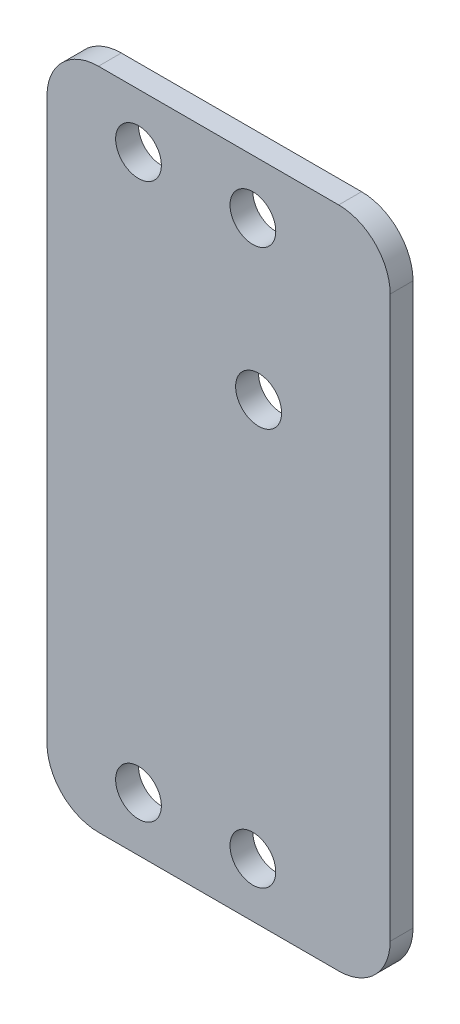
ISO-10303-21;
HEADER;
FILE_DESCRIPTION(('STEP AP214'),'2;1');
FILE_NAME('part.step','',(''),(''),'','','');
FILE_SCHEMA(('AUTOMOTIVE_DESIGN { 1 0 10303 214 1 1 1 1 }'));
ENDSEC;
DATA;
#1=APPLICATION_CONTEXT('core data for automotive mechanical design processes');
#2=APPLICATION_PROTOCOL_DEFINITION('international standard','automotive_design',2000,#1);
#3=PRODUCT_CONTEXT('',#1,'mechanical');
#4=PRODUCT('Part','Part','',(#3));
#5=PRODUCT_RELATED_PRODUCT_CATEGORY('part','',(#4));
#6=PRODUCT_DEFINITION_FORMATION('','',#4);
#7=PRODUCT_DEFINITION_CONTEXT('part definition',#1,'design');
#8=PRODUCT_DEFINITION('design','',#6,#7);
#9=PRODUCT_DEFINITION_SHAPE('','',#8);
#10=(LENGTH_UNIT() NAMED_UNIT(*) SI_UNIT(.MILLI.,.METRE.));
#11=(NAMED_UNIT(*) PLANE_ANGLE_UNIT() SI_UNIT($,.RADIAN.));
#12=(NAMED_UNIT(*) SI_UNIT($,.STERADIAN.) SOLID_ANGLE_UNIT());
#13=UNCERTAINTY_MEASURE_WITH_UNIT(LENGTH_MEASURE(1.E-05),#10,'distance_accuracy_value','');
#14=(GEOMETRIC_REPRESENTATION_CONTEXT(3) GLOBAL_UNCERTAINTY_ASSIGNED_CONTEXT((#13)) GLOBAL_UNIT_ASSIGNED_CONTEXT((#10,
#11,#12)) REPRESENTATION_CONTEXT('',''));
#15=CARTESIAN_POINT('',(0.,0.,0.));
#16=DIRECTION('',(0.,0.,1.));
#17=DIRECTION('',(1.,0.,0.));
#18=AXIS2_PLACEMENT_3D('',#15,#16,#17);
#19=CARTESIAN_POINT('',(0.,0.,2.));
#20=DIRECTION('',(0.,0.,1.));
#21=DIRECTION('',(1.,0.,0.));
#22=AXIS2_PLACEMENT_3D('',#19,#20,#21);
#23=PLANE('',#22);
#24=CARTESIAN_POINT('',(3.,-24.25,2.));
#25=DIRECTION('',(0.,0.,1.));
#26=DIRECTION('',(1.,0.,0.));
#27=AXIS2_PLACEMENT_3D('',#24,#25,#26);
#28=CIRCLE('',#27,2.);
#29=CARTESIAN_POINT('',(5.,-24.25,2.));
#30=VERTEX_POINT('',#29);
#31=EDGE_CURVE('E197',#30,#30,#28,.T.);
#32=ORIENTED_EDGE('',*,*,#31,.F.);
#33=EDGE_LOOP('',(#32));
#34=FACE_BOUND('',#33,.T.);
#35=CARTESIAN_POINT('',(-7.00000000000001,24.25,2.));
#36=DIRECTION('',(0.,0.,1.));
#37=DIRECTION('',(1.,0.,0.));
#38=AXIS2_PLACEMENT_3D('',#35,#36,#37);
#39=CIRCLE('',#38,2.);
#40=CARTESIAN_POINT('',(-5.00000000000001,24.25,2.));
#41=VERTEX_POINT('',#40);
#42=EDGE_CURVE('E186',#41,#41,#39,.T.);
#43=ORIENTED_EDGE('',*,*,#42,.F.);
#44=EDGE_LOOP('',(#43));
#45=FACE_BOUND('',#44,.T.);
#46=DIRECTION('',(1.,0.,0.));
#47=VECTOR('',#46,1.);
#48=CARTESIAN_POINT('',(-15.,-29.,2.));
#49=LINE('',#48,#47);
#50=CARTESIAN_POINT('',(-10.5,-29.,2.));
#51=VERTEX_POINT('',#50);
#52=CARTESIAN_POINT('',(10.5,-29.,2.));
#53=VERTEX_POINT('',#52);
#54=EDGE_CURVE('E173',#51,#53,#49,.T.);
#55=ORIENTED_EDGE('',*,*,#54,.T.);
#56=CARTESIAN_POINT('',(10.5,-24.5,2.));
#57=DIRECTION('',(0.,0.,1.));
#58=DIRECTION('',(1.,0.,0.));
#59=AXIS2_PLACEMENT_3D('',#56,#57,#58);
#60=CIRCLE('',#59,4.5);
#61=CARTESIAN_POINT('',(15.,-24.5,2.));
#62=VERTEX_POINT('',#61);
#63=EDGE_CURVE('E153',#53,#62,#60,.T.);
#64=ORIENTED_EDGE('',*,*,#63,.T.);
#65=DIRECTION('',(0.,1.,0.));
#66=VECTOR('',#65,1.);
#67=CARTESIAN_POINT('',(15.,29.,2.));
#68=LINE('',#67,#66);
#69=CARTESIAN_POINT('',(15.,24.5,2.));
#70=VERTEX_POINT('',#69);
#71=EDGE_CURVE('E104',#62,#70,#68,.T.);
#72=ORIENTED_EDGE('',*,*,#71,.T.);
#73=CARTESIAN_POINT('',(10.5,24.5,2.));
#74=DIRECTION('',(0.,0.,1.));
#75=DIRECTION('',(1.,0.,0.));
#76=AXIS2_PLACEMENT_3D('',#73,#74,#75);
#77=CIRCLE('',#76,4.5);
#78=CARTESIAN_POINT('',(10.5,29.,2.));
#79=VERTEX_POINT('',#78);
#80=EDGE_CURVE('E147',#70,#79,#77,.T.);
#81=ORIENTED_EDGE('',*,*,#80,.T.);
#82=DIRECTION('',(-1.,0.,0.));
#83=VECTOR('',#82,1.);
#84=CARTESIAN_POINT('',(-15.,29.,2.));
#85=LINE('',#84,#83);
#86=CARTESIAN_POINT('',(-10.5,29.,2.));
#87=VERTEX_POINT('',#86);
#88=EDGE_CURVE('E135',#79,#87,#85,.T.);
#89=ORIENTED_EDGE('',*,*,#88,.T.);
#90=CARTESIAN_POINT('',(-10.5,24.5,2.));
#91=DIRECTION('',(0.,0.,1.));
#92=DIRECTION('',(1.,0.,0.));
#93=AXIS2_PLACEMENT_3D('',#90,#91,#92);
#94=CIRCLE('',#93,4.5);
#95=CARTESIAN_POINT('',(-15.,24.5,2.));
#96=VERTEX_POINT('',#95);
#97=EDGE_CURVE('E144',#87,#96,#94,.T.);
#98=ORIENTED_EDGE('',*,*,#97,.T.);
#99=DIRECTION('',(0.,-1.,0.));
#100=VECTOR('',#99,1.);
#101=CARTESIAN_POINT('',(-15.,29.,2.));
#102=LINE('',#101,#100);
#103=CARTESIAN_POINT('',(-15.,-24.5,2.));
#104=VERTEX_POINT('',#103);
#105=EDGE_CURVE('E129',#96,#104,#102,.T.);
#106=ORIENTED_EDGE('',*,*,#105,.T.);
#107=CARTESIAN_POINT('',(-10.5,-24.5,2.));
#108=DIRECTION('',(0.,0.,1.));
#109=DIRECTION('',(1.,0.,0.));
#110=AXIS2_PLACEMENT_3D('',#107,#108,#109);
#111=CIRCLE('',#110,4.5);
#112=EDGE_CURVE('E150',#104,#51,#111,.T.);
#113=ORIENTED_EDGE('',*,*,#112,.T.);
#114=EDGE_LOOP('',(#55,#64,#72,#81,#89,#98,#106,#113));
#115=FACE_BOUND('',#114,.T.);
#116=CARTESIAN_POINT('',(2.99999999999999,24.25,2.));
#117=DIRECTION('',(0.,0.,1.));
#118=DIRECTION('',(1.,0.,0.));
#119=AXIS2_PLACEMENT_3D('',#116,#117,#118);
#120=CIRCLE('',#119,2.);
#121=CARTESIAN_POINT('',(4.99999999999999,24.25,2.));
#122=VERTEX_POINT('',#121);
#123=EDGE_CURVE('E181',#122,#122,#120,.T.);
#124=ORIENTED_EDGE('',*,*,#123,.F.);
#125=EDGE_LOOP('',(#124));
#126=FACE_BOUND('',#125,.T.);
#127=CARTESIAN_POINT('',(-7.,-24.25,2.));
#128=DIRECTION('',(0.,0.,1.));
#129=DIRECTION('',(1.,0.,0.));
#130=AXIS2_PLACEMENT_3D('',#127,#128,#129);
#131=CIRCLE('',#130,2.);
#132=CARTESIAN_POINT('',(-5.,-24.25,2.));
#133=VERTEX_POINT('',#132);
#134=EDGE_CURVE('E191',#133,#133,#131,.T.);
#135=ORIENTED_EDGE('',*,*,#134,.F.);
#136=EDGE_LOOP('',(#135));
#137=FACE_BOUND('',#136,.T.);
#138=CARTESIAN_POINT('',(3.5,10.75,2.));
#139=DIRECTION('',(0.,0.,1.));
#140=DIRECTION('',(1.,0.,0.));
#141=AXIS2_PLACEMENT_3D('',#138,#139,#140);
#142=CIRCLE('',#141,2.01);
#143=CARTESIAN_POINT('',(5.51,10.75,2.));
#144=VERTEX_POINT('',#143);
#145=EDGE_CURVE('E203',#144,#144,#142,.T.);
#146=ORIENTED_EDGE('',*,*,#145,.F.);
#147=EDGE_LOOP('',(#146));
#148=FACE_BOUND('',#147,.T.);
#149=ADVANCED_FACE('F35',(#34,#45,#115,#126,#137,#148),#23,.T.);
#150=CARTESIAN_POINT('',(0.,0.,0.));
#151=DIRECTION('',(0.,0.,1.));
#152=DIRECTION('',(1.,0.,0.));
#153=AXIS2_PLACEMENT_3D('',#150,#151,#152);
#154=PLANE('',#153);
#155=DIRECTION('',(0.,1.,0.));
#156=VECTOR('',#155,1.);
#157=CARTESIAN_POINT('',(15.,29.,0.));
#158=LINE('',#157,#156);
#159=CARTESIAN_POINT('',(15.,-24.5,0.));
#160=VERTEX_POINT('',#159);
#161=CARTESIAN_POINT('',(15.,24.5,0.));
#162=VERTEX_POINT('',#161);
#163=EDGE_CURVE('E102',#160,#162,#158,.T.);
#164=ORIENTED_EDGE('',*,*,#163,.F.);
#165=CARTESIAN_POINT('',(10.5,-24.5,0.));
#166=DIRECTION('',(0.,0.,1.));
#167=DIRECTION('',(1.,0.,0.));
#168=AXIS2_PLACEMENT_3D('',#165,#166,#167);
#169=CIRCLE('',#168,4.5);
#170=CARTESIAN_POINT('',(10.5,-29.,0.));
#171=VERTEX_POINT('',#170);
#172=EDGE_CURVE('E112',#160,#171,#169,.F.);
#173=ORIENTED_EDGE('',*,*,#172,.T.);
#174=DIRECTION('',(1.,0.,0.));
#175=VECTOR('',#174,1.);
#176=CARTESIAN_POINT('',(-15.,-29.,0.));
#177=LINE('',#176,#175);
#178=CARTESIAN_POINT('',(-10.5,-29.,0.));
#179=VERTEX_POINT('',#178);
#180=EDGE_CURVE('E127',#179,#171,#177,.T.);
#181=ORIENTED_EDGE('',*,*,#180,.F.);
#182=CARTESIAN_POINT('',(-10.5,-24.5,0.));
#183=DIRECTION('',(0.,0.,1.));
#184=DIRECTION('',(1.,0.,0.));
#185=AXIS2_PLACEMENT_3D('',#182,#183,#184);
#186=CIRCLE('',#185,4.5);
#187=CARTESIAN_POINT('',(-15.,-24.5,0.));
#188=VERTEX_POINT('',#187);
#189=EDGE_CURVE('E119',#179,#188,#186,.F.);
#190=ORIENTED_EDGE('',*,*,#189,.T.);
#191=DIRECTION('',(0.,-1.,0.));
#192=VECTOR('',#191,1.);
#193=CARTESIAN_POINT('',(-15.,29.,0.));
#194=LINE('',#193,#192);
#195=CARTESIAN_POINT('',(-15.,24.5,0.));
#196=VERTEX_POINT('',#195);
#197=EDGE_CURVE('E131',#196,#188,#194,.T.);
#198=ORIENTED_EDGE('',*,*,#197,.F.);
#199=CARTESIAN_POINT('',(-10.5,24.5,0.));
#200=DIRECTION('',(0.,0.,1.));
#201=DIRECTION('',(1.,0.,0.));
#202=AXIS2_PLACEMENT_3D('',#199,#200,#201);
#203=CIRCLE('',#202,4.5);
#204=CARTESIAN_POINT('',(-10.5,29.,0.));
#205=VERTEX_POINT('',#204);
#206=EDGE_CURVE('E108',#196,#205,#203,.F.);
#207=ORIENTED_EDGE('',*,*,#206,.T.);
#208=DIRECTION('',(-1.,0.,0.));
#209=VECTOR('',#208,1.);
#210=CARTESIAN_POINT('',(-15.,29.,0.));
#211=LINE('',#210,#209);
#212=CARTESIAN_POINT('',(10.5,29.,0.));
#213=VERTEX_POINT('',#212);
#214=EDGE_CURVE('E126',#213,#205,#211,.T.);
#215=ORIENTED_EDGE('',*,*,#214,.F.);
#216=CARTESIAN_POINT('',(10.5,24.5,0.));
#217=DIRECTION('',(0.,0.,1.));
#218=DIRECTION('',(1.,0.,0.));
#219=AXIS2_PLACEMENT_3D('',#216,#217,#218);
#220=CIRCLE('',#219,4.5);
#221=EDGE_CURVE('E125',#213,#162,#220,.F.);
#222=ORIENTED_EDGE('',*,*,#221,.T.);
#223=EDGE_LOOP('',(#164,#173,#181,#190,#198,#207,#215,#222));
#224=FACE_BOUND('',#223,.T.);
#225=CARTESIAN_POINT('',(2.99999999999999,24.25,0.));
#226=DIRECTION('',(0.,0.,1.));
#227=DIRECTION('',(1.,0.,0.));
#228=AXIS2_PLACEMENT_3D('',#225,#226,#227);
#229=CIRCLE('',#228,2.);
#230=CARTESIAN_POINT('',(4.99999999999999,24.25,0.));
#231=VERTEX_POINT('',#230);
#232=EDGE_CURVE('E177',#231,#231,#229,.T.);
#233=ORIENTED_EDGE('',*,*,#232,.T.);
#234=EDGE_LOOP('',(#233));
#235=FACE_BOUND('',#234,.T.);
#236=CARTESIAN_POINT('',(-7.00000000000001,24.25,0.));
#237=DIRECTION('',(0.,0.,1.));
#238=DIRECTION('',(1.,0.,0.));
#239=AXIS2_PLACEMENT_3D('',#236,#237,#238);
#240=CIRCLE('',#239,2.);
#241=CARTESIAN_POINT('',(-5.00000000000001,24.25,0.));
#242=VERTEX_POINT('',#241);
#243=EDGE_CURVE('E188',#242,#242,#240,.T.);
#244=ORIENTED_EDGE('',*,*,#243,.T.);
#245=EDGE_LOOP('',(#244));
#246=FACE_BOUND('',#245,.T.);
#247=CARTESIAN_POINT('',(-7.,-24.25,0.));
#248=DIRECTION('',(0.,0.,1.));
#249=DIRECTION('',(1.,0.,0.));
#250=AXIS2_PLACEMENT_3D('',#247,#248,#249);
#251=CIRCLE('',#250,2.);
#252=CARTESIAN_POINT('',(-5.,-24.25,0.));
#253=VERTEX_POINT('',#252);
#254=EDGE_CURVE('E194',#253,#253,#251,.T.);
#255=ORIENTED_EDGE('',*,*,#254,.T.);
#256=EDGE_LOOP('',(#255));
#257=FACE_BOUND('',#256,.T.);
#258=CARTESIAN_POINT('',(3.,-24.25,0.));
#259=DIRECTION('',(0.,0.,1.));
#260=DIRECTION('',(1.,0.,0.));
#261=AXIS2_PLACEMENT_3D('',#258,#259,#260);
#262=CIRCLE('',#261,2.);
#263=CARTESIAN_POINT('',(5.,-24.25,0.));
#264=VERTEX_POINT('',#263);
#265=EDGE_CURVE('E200',#264,#264,#262,.T.);
#266=ORIENTED_EDGE('',*,*,#265,.T.);
#267=EDGE_LOOP('',(#266));
#268=FACE_BOUND('',#267,.T.);
#269=CARTESIAN_POINT('',(3.5,10.75,0.));
#270=DIRECTION('',(0.,0.,1.));
#271=DIRECTION('',(1.,0.,0.));
#272=AXIS2_PLACEMENT_3D('',#269,#270,#271);
#273=CIRCLE('',#272,2.01);
#274=CARTESIAN_POINT('',(5.51,10.75,0.));
#275=VERTEX_POINT('',#274);
#276=EDGE_CURVE('E206',#275,#275,#273,.T.);
#277=ORIENTED_EDGE('',*,*,#276,.T.);
#278=EDGE_LOOP('',(#277));
#279=FACE_BOUND('',#278,.T.);
#280=ADVANCED_FACE('F122',(#224,#235,#246,#257,#268,#279),#154,.F.);
#281=CARTESIAN_POINT('',(-15.,29.,2.));
#282=DIRECTION('',(1.,0.,0.));
#283=DIRECTION('',(0.,0.,-1.));
#284=AXIS2_PLACEMENT_3D('',#281,#282,#283);
#285=PLANE('',#284);
#286=ORIENTED_EDGE('',*,*,#197,.T.);
#287=DIRECTION('',(0.,0.,-1.));
#288=VECTOR('',#287,1.);
#289=CARTESIAN_POINT('',(-15.,-24.5,2.));
#290=LINE('',#289,#288);
#291=EDGE_CURVE('E157',#188,#104,#290,.F.);
#292=ORIENTED_EDGE('',*,*,#291,.T.);
#293=ORIENTED_EDGE('',*,*,#105,.F.);
#294=DIRECTION('',(0.,0.,-1.));
#295=VECTOR('',#294,1.);
#296=CARTESIAN_POINT('',(-15.,24.5,2.));
#297=LINE('',#296,#295);
#298=EDGE_CURVE('E155',#96,#196,#297,.T.);
#299=ORIENTED_EDGE('',*,*,#298,.T.);
#300=EDGE_LOOP('',(#286,#292,#293,#299));
#301=FACE_BOUND('',#300,.T.);
#302=ADVANCED_FACE('F162',(#301),#285,.F.);
#303=CARTESIAN_POINT('',(-15.,-29.,2.));
#304=DIRECTION('',(0.,1.,0.));
#305=DIRECTION('',(0.,0.,1.));
#306=AXIS2_PLACEMENT_3D('',#303,#304,#305);
#307=PLANE('',#306);
#308=ORIENTED_EDGE('',*,*,#180,.T.);
#309=DIRECTION('',(0.,0.,-1.));
#310=VECTOR('',#309,1.);
#311=CARTESIAN_POINT('',(10.5,-29.,2.));
#312=LINE('',#311,#310);
#313=EDGE_CURVE('E114',#171,#53,#312,.F.);
#314=ORIENTED_EDGE('',*,*,#313,.T.);
#315=ORIENTED_EDGE('',*,*,#54,.F.);
#316=DIRECTION('',(0.,0.,-1.));
#317=VECTOR('',#316,1.);
#318=CARTESIAN_POINT('',(-10.5,-29.,2.));
#319=LINE('',#318,#317);
#320=EDGE_CURVE('E118',#51,#179,#319,.T.);
#321=ORIENTED_EDGE('',*,*,#320,.T.);
#322=EDGE_LOOP('',(#308,#314,#315,#321));
#323=FACE_BOUND('',#322,.T.);
#324=ADVANCED_FACE('F233',(#323),#307,.F.);
#325=CARTESIAN_POINT('',(15.,29.,2.));
#326=DIRECTION('',(-1.,0.,0.));
#327=DIRECTION('',(0.,0.,1.));
#328=AXIS2_PLACEMENT_3D('',#325,#326,#327);
#329=PLANE('',#328);
#330=ORIENTED_EDGE('',*,*,#71,.F.);
#331=DIRECTION('',(0.,0.,-1.));
#332=VECTOR('',#331,1.);
#333=CARTESIAN_POINT('',(15.,-24.5,2.));
#334=LINE('',#333,#332);
#335=EDGE_CURVE('E98',#62,#160,#334,.T.);
#336=ORIENTED_EDGE('',*,*,#335,.T.);
#337=ORIENTED_EDGE('',*,*,#163,.T.);
#338=DIRECTION('',(0.,0.,-1.));
#339=VECTOR('',#338,1.);
#340=CARTESIAN_POINT('',(15.,24.5,2.));
#341=LINE('',#340,#339);
#342=EDGE_CURVE('E109',#162,#70,#341,.F.);
#343=ORIENTED_EDGE('',*,*,#342,.T.);
#344=EDGE_LOOP('',(#330,#336,#337,#343));
#345=FACE_BOUND('',#344,.T.);
#346=ADVANCED_FACE('F100',(#345),#329,.F.);
#347=CARTESIAN_POINT('',(-15.,29.,2.));
#348=DIRECTION('',(0.,-1.,0.));
#349=DIRECTION('',(0.,0.,-1.));
#350=AXIS2_PLACEMENT_3D('',#347,#348,#349);
#351=PLANE('',#350);
#352=ORIENTED_EDGE('',*,*,#88,.F.);
#353=DIRECTION('',(0.,0.,-1.));
#354=VECTOR('',#353,1.);
#355=CARTESIAN_POINT('',(10.5,29.,2.));
#356=LINE('',#355,#354);
#357=EDGE_CURVE('E11',#79,#213,#356,.T.);
#358=ORIENTED_EDGE('',*,*,#357,.T.);
#359=ORIENTED_EDGE('',*,*,#214,.T.);
#360=DIRECTION('',(0.,0.,-1.));
#361=VECTOR('',#360,1.);
#362=CARTESIAN_POINT('',(-10.5,29.,2.));
#363=LINE('',#362,#361);
#364=EDGE_CURVE('E43',#205,#87,#363,.F.);
#365=ORIENTED_EDGE('',*,*,#364,.T.);
#366=EDGE_LOOP('',(#352,#358,#359,#365));
#367=FACE_BOUND('',#366,.T.);
#368=ADVANCED_FACE('F228',(#367),#351,.F.);
#369=CARTESIAN_POINT('',(2.99999999999999,24.25,2.));
#370=DIRECTION('',(0.,0.,-1.));
#371=DIRECTION('',(-1.,0.,0.));
#372=AXIS2_PLACEMENT_3D('',#369,#370,#371);
#373=CYLINDRICAL_SURFACE('',#372,2.);
#374=ORIENTED_EDGE('',*,*,#123,.T.);
#375=EDGE_LOOP('',(#374));
#376=FACE_BOUND('',#375,.T.);
#377=ORIENTED_EDGE('',*,*,#232,.F.);
#378=EDGE_LOOP('',(#377));
#379=FACE_BOUND('',#378,.T.);
#380=ADVANCED_FACE('F225',(#376,#379),#373,.F.);
#381=CARTESIAN_POINT('',(-7.00000000000001,24.25,2.));
#382=DIRECTION('',(0.,0.,-1.));
#383=DIRECTION('',(-1.,0.,0.));
#384=AXIS2_PLACEMENT_3D('',#381,#382,#383);
#385=CYLINDRICAL_SURFACE('',#384,2.);
#386=ORIENTED_EDGE('',*,*,#42,.T.);
#387=EDGE_LOOP('',(#386));
#388=FACE_BOUND('',#387,.T.);
#389=ORIENTED_EDGE('',*,*,#243,.F.);
#390=EDGE_LOOP('',(#389));
#391=FACE_BOUND('',#390,.T.);
#392=ADVANCED_FACE('F295',(#388,#391),#385,.F.);
#393=CARTESIAN_POINT('',(-7.,-24.25,2.));
#394=DIRECTION('',(0.,0.,-1.));
#395=DIRECTION('',(-1.,0.,0.));
#396=AXIS2_PLACEMENT_3D('',#393,#394,#395);
#397=CYLINDRICAL_SURFACE('',#396,2.);
#398=ORIENTED_EDGE('',*,*,#134,.T.);
#399=EDGE_LOOP('',(#398));
#400=FACE_BOUND('',#399,.T.);
#401=ORIENTED_EDGE('',*,*,#254,.F.);
#402=EDGE_LOOP('',(#401));
#403=FACE_BOUND('',#402,.T.);
#404=ADVANCED_FACE('F285',(#400,#403),#397,.F.);
#405=CARTESIAN_POINT('',(3.,-24.25,2.));
#406=DIRECTION('',(0.,0.,-1.));
#407=DIRECTION('',(-1.,0.,0.));
#408=AXIS2_PLACEMENT_3D('',#405,#406,#407);
#409=CYLINDRICAL_SURFACE('',#408,2.);
#410=ORIENTED_EDGE('',*,*,#31,.T.);
#411=EDGE_LOOP('',(#410));
#412=FACE_BOUND('',#411,.T.);
#413=ORIENTED_EDGE('',*,*,#265,.F.);
#414=EDGE_LOOP('',(#413));
#415=FACE_BOUND('',#414,.T.);
#416=ADVANCED_FACE('F276',(#412,#415),#409,.F.);
#417=CARTESIAN_POINT('',(3.5,10.75,2.));
#418=DIRECTION('',(0.,0.,-1.));
#419=DIRECTION('',(-1.,0.,0.));
#420=AXIS2_PLACEMENT_3D('',#417,#418,#419);
#421=CYLINDRICAL_SURFACE('',#420,2.01);
#422=ORIENTED_EDGE('',*,*,#145,.T.);
#423=EDGE_LOOP('',(#422));
#424=FACE_BOUND('',#423,.T.);
#425=ORIENTED_EDGE('',*,*,#276,.F.);
#426=EDGE_LOOP('',(#425));
#427=FACE_BOUND('',#426,.T.);
#428=ADVANCED_FACE('F212',(#424,#427),#421,.F.);
#429=CARTESIAN_POINT('',(10.5,-24.5,2.));
#430=DIRECTION('',(0.,0.,-1.));
#431=DIRECTION('',(-1.,0.,0.));
#432=AXIS2_PLACEMENT_3D('',#429,#430,#431);
#433=CYLINDRICAL_SURFACE('',#432,4.5);
#434=ORIENTED_EDGE('',*,*,#63,.F.);
#435=ORIENTED_EDGE('',*,*,#313,.F.);
#436=ORIENTED_EDGE('',*,*,#172,.F.);
#437=ORIENTED_EDGE('',*,*,#335,.F.);
#438=EDGE_LOOP('',(#434,#435,#436,#437));
#439=FACE_BOUND('',#438,.T.);
#440=ADVANCED_FACE('F113',(#439),#433,.T.);
#441=CARTESIAN_POINT('',(-10.5,-24.5,2.));
#442=DIRECTION('',(0.,0.,-1.));
#443=DIRECTION('',(-1.,0.,0.));
#444=AXIS2_PLACEMENT_3D('',#441,#442,#443);
#445=CYLINDRICAL_SURFACE('',#444,4.5);
#446=ORIENTED_EDGE('',*,*,#112,.F.);
#447=ORIENTED_EDGE('',*,*,#291,.F.);
#448=ORIENTED_EDGE('',*,*,#189,.F.);
#449=ORIENTED_EDGE('',*,*,#320,.F.);
#450=EDGE_LOOP('',(#446,#447,#448,#449));
#451=FACE_BOUND('',#450,.T.);
#452=ADVANCED_FACE('F167',(#451),#445,.T.);
#453=CARTESIAN_POINT('',(10.5,24.5,2.));
#454=DIRECTION('',(0.,0.,-1.));
#455=DIRECTION('',(-1.,0.,0.));
#456=AXIS2_PLACEMENT_3D('',#453,#454,#455);
#457=CYLINDRICAL_SURFACE('',#456,4.5);
#458=ORIENTED_EDGE('',*,*,#80,.F.);
#459=ORIENTED_EDGE('',*,*,#342,.F.);
#460=ORIENTED_EDGE('',*,*,#221,.F.);
#461=ORIENTED_EDGE('',*,*,#357,.F.);
#462=EDGE_LOOP('',(#458,#459,#460,#461));
#463=FACE_BOUND('',#462,.T.);
#464=ADVANCED_FACE('F242',(#463),#457,.T.);
#465=CARTESIAN_POINT('',(-10.5,24.5,2.));
#466=DIRECTION('',(0.,0.,-1.));
#467=DIRECTION('',(-1.,0.,0.));
#468=AXIS2_PLACEMENT_3D('',#465,#466,#467);
#469=CYLINDRICAL_SURFACE('',#468,4.5);
#470=ORIENTED_EDGE('',*,*,#97,.F.);
#471=ORIENTED_EDGE('',*,*,#364,.F.);
#472=ORIENTED_EDGE('',*,*,#206,.F.);
#473=ORIENTED_EDGE('',*,*,#298,.F.);
#474=EDGE_LOOP('',(#470,#471,#472,#473));
#475=FACE_BOUND('',#474,.T.);
#476=ADVANCED_FACE('F37',(#475),#469,.T.);
#477=CLOSED_SHELL('',(#149,#280,#302,#324,#346,#368,#380,#392,#404,#416,#428,#440,#452,#464,#476));
#478=MANIFOLD_SOLID_BREP('B2',#477);
#479=ADVANCED_BREP_SHAPE_REPRESENTATION('',(#18,#478),#14);
#480=SHAPE_DEFINITION_REPRESENTATION(#9,#479);
ENDSEC;
END-ISO-10303-21;
